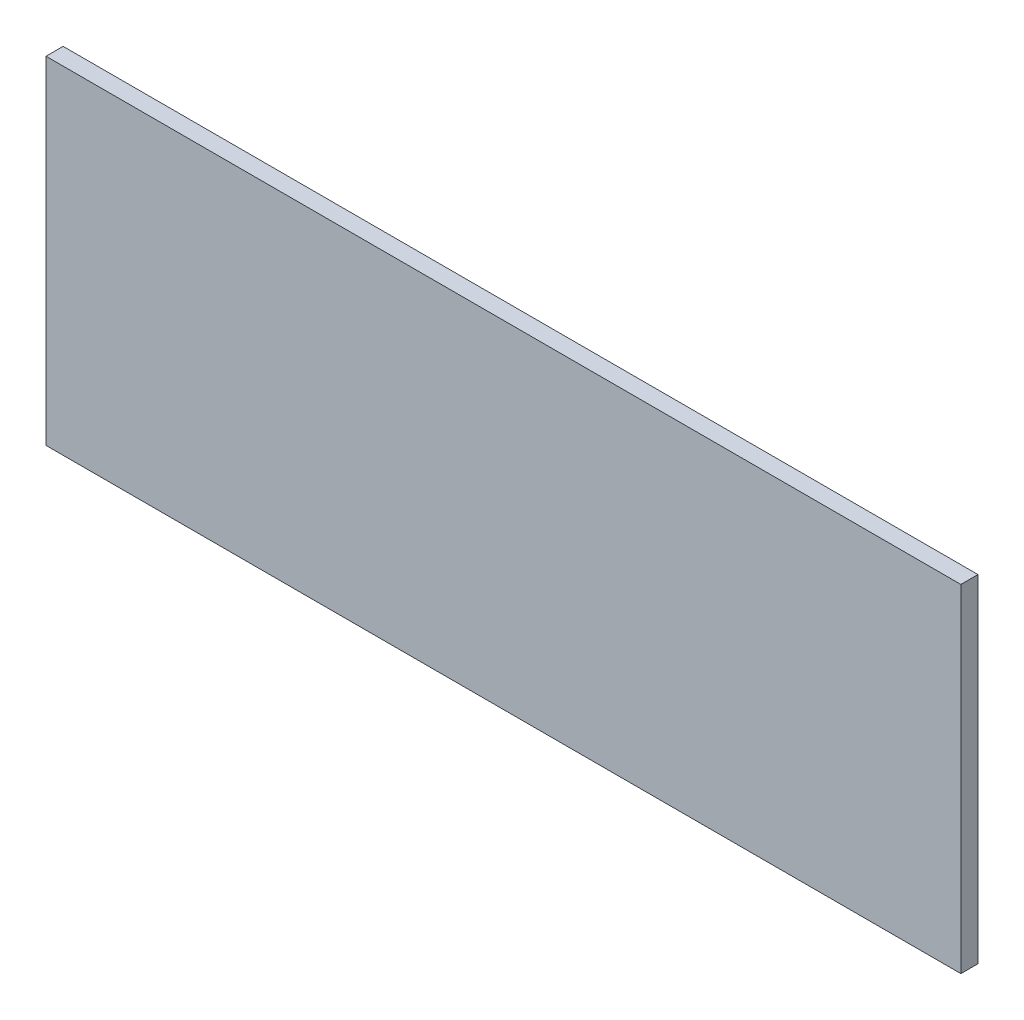
ISO-10303-21;
HEADER;
FILE_DESCRIPTION(('STEP AP214'),'2;1');
FILE_NAME('part.step','',(''),(''),'','','');
FILE_SCHEMA(('AUTOMOTIVE_DESIGN { 1 0 10303 214 1 1 1 1 }'));
ENDSEC;
DATA;
#1=APPLICATION_CONTEXT('core data for automotive mechanical design processes');
#2=APPLICATION_PROTOCOL_DEFINITION('international standard','automotive_design',2000,#1);
#3=PRODUCT_CONTEXT('',#1,'mechanical');
#4=PRODUCT('Part','Part','',(#3));
#5=PRODUCT_RELATED_PRODUCT_CATEGORY('part','',(#4));
#6=PRODUCT_DEFINITION_FORMATION('','',#4);
#7=PRODUCT_DEFINITION_CONTEXT('part definition',#1,'design');
#8=PRODUCT_DEFINITION('design','',#6,#7);
#9=PRODUCT_DEFINITION_SHAPE('','',#8);
#10=(LENGTH_UNIT() NAMED_UNIT(*) SI_UNIT(.MILLI.,.METRE.));
#11=(NAMED_UNIT(*) PLANE_ANGLE_UNIT() SI_UNIT($,.RADIAN.));
#12=(NAMED_UNIT(*) SI_UNIT($,.STERADIAN.) SOLID_ANGLE_UNIT());
#13=UNCERTAINTY_MEASURE_WITH_UNIT(LENGTH_MEASURE(1.E-05),#10,'distance_accuracy_value','');
#14=(GEOMETRIC_REPRESENTATION_CONTEXT(3) GLOBAL_UNCERTAINTY_ASSIGNED_CONTEXT((#13)) GLOBAL_UNIT_ASSIGNED_CONTEXT((#10,
#11,#12)) REPRESENTATION_CONTEXT('',''));
#15=CARTESIAN_POINT('',(0.,0.,0.));
#16=DIRECTION('',(0.,0.,1.));
#17=DIRECTION('',(1.,0.,0.));
#18=AXIS2_PLACEMENT_3D('',#15,#16,#17);
#19=CARTESIAN_POINT('',(96.5670013427734,63.8370018005371,0.));
#20=DIRECTION('',(0.,1.,0.));
#21=DIRECTION('',(1.,0.,0.));
#22=AXIS2_PLACEMENT_3D('',#19,#20,#21);
#23=PLANE('',#22);
#24=DIRECTION('',(1.,0.,0.));
#25=VECTOR('',#24,1.);
#26=CARTESIAN_POINT('',(96.5670013427734,63.8370018005371,0.03556));
#27=LINE('',#26,#25);
#28=CARTESIAN_POINT('',(96.5670013427734,63.8370018005371,0.03556));
#29=VERTEX_POINT('',#28);
#30=CARTESIAN_POINT('',(98.4670028686523,63.8370018005371,0.03556));
#31=VERTEX_POINT('',#30);
#32=EDGE_CURVE('E11',#29,#31,#27,.T.);
#33=ORIENTED_EDGE('',*,*,#32,.F.);
#34=DIRECTION('',(0.,0.,1.));
#35=VECTOR('',#34,1.);
#36=CARTESIAN_POINT('',(96.5670013427734,63.8370018005371,0.));
#37=LINE('',#36,#35);
#38=CARTESIAN_POINT('',(96.5670013427734,63.8370018005371,0.));
#39=VERTEX_POINT('',#38);
#40=EDGE_CURVE('E24',#39,#29,#37,.T.);
#41=ORIENTED_EDGE('',*,*,#40,.F.);
#42=DIRECTION('',(1.,0.,0.));
#43=VECTOR('',#42,1.);
#44=CARTESIAN_POINT('',(96.5670013427734,63.8370018005371,0.));
#45=LINE('',#44,#43);
#46=CARTESIAN_POINT('',(98.4670028686523,63.8370018005371,0.));
#47=VERTEX_POINT('',#46);
#48=EDGE_CURVE('E75',#39,#47,#45,.T.);
#49=ORIENTED_EDGE('',*,*,#48,.T.);
#50=DIRECTION('',(0.,0.,1.));
#51=VECTOR('',#50,1.);
#52=CARTESIAN_POINT('',(98.4670028686523,63.8370018005371,0.));
#53=LINE('',#52,#51);
#54=EDGE_CURVE('E37',#47,#31,#53,.T.);
#55=ORIENTED_EDGE('',*,*,#54,.T.);
#56=EDGE_LOOP('',(#33,#41,#49,#55));
#57=FACE_BOUND('',#56,.T.);
#58=ADVANCED_FACE('F17',(#57),#23,.F.);
#59=CARTESIAN_POINT('',(98.4670028686523,63.8370018005371,0.));
#60=DIRECTION('',(-1.,0.,0.));
#61=DIRECTION('',(0.,1.,0.));
#62=AXIS2_PLACEMENT_3D('',#59,#60,#61);
#63=PLANE('',#62);
#64=DIRECTION('',(0.,1.,0.));
#65=VECTOR('',#64,1.);
#66=CARTESIAN_POINT('',(98.4670028686523,63.8370018005371,0.03556));
#67=LINE('',#66,#65);
#68=CARTESIAN_POINT('',(98.4670028686523,64.5370025634766,0.03556));
#69=VERTEX_POINT('',#68);
#70=EDGE_CURVE('E83',#31,#69,#67,.T.);
#71=ORIENTED_EDGE('',*,*,#70,.F.);
#72=ORIENTED_EDGE('',*,*,#54,.F.);
#73=DIRECTION('',(0.,1.,0.));
#74=VECTOR('',#73,1.);
#75=CARTESIAN_POINT('',(98.4670028686523,63.8370018005371,0.));
#76=LINE('',#75,#74);
#77=CARTESIAN_POINT('',(98.4670028686523,64.5370025634766,0.));
#78=VERTEX_POINT('',#77);
#79=EDGE_CURVE('E81',#47,#78,#76,.T.);
#80=ORIENTED_EDGE('',*,*,#79,.T.);
#81=DIRECTION('',(0.,0.,1.));
#82=VECTOR('',#81,1.);
#83=CARTESIAN_POINT('',(98.4670028686523,64.5370025634766,0.));
#84=LINE('',#83,#82);
#85=EDGE_CURVE('E67',#78,#69,#84,.T.);
#86=ORIENTED_EDGE('',*,*,#85,.T.);
#87=EDGE_LOOP('',(#71,#72,#80,#86));
#88=FACE_BOUND('',#87,.T.);
#89=ADVANCED_FACE('F89',(#88),#63,.F.);
#90=CARTESIAN_POINT('',(98.4670028686523,64.5370025634766,0.));
#91=DIRECTION('',(0.,-1.,0.));
#92=DIRECTION('',(-1.,0.,0.));
#93=AXIS2_PLACEMENT_3D('',#90,#91,#92);
#94=PLANE('',#93);
#95=DIRECTION('',(-1.,0.,0.));
#96=VECTOR('',#95,1.);
#97=CARTESIAN_POINT('',(98.4670028686523,64.5370025634766,0.03556));
#98=LINE('',#97,#96);
#99=CARTESIAN_POINT('',(96.5670013427734,64.5370025634766,0.03556));
#100=VERTEX_POINT('',#99);
#101=EDGE_CURVE('E71',#69,#100,#98,.T.);
#102=ORIENTED_EDGE('',*,*,#101,.F.);
#103=ORIENTED_EDGE('',*,*,#85,.F.);
#104=DIRECTION('',(-1.,0.,0.));
#105=VECTOR('',#104,1.);
#106=CARTESIAN_POINT('',(98.4670028686523,64.5370025634766,0.));
#107=LINE('',#106,#105);
#108=CARTESIAN_POINT('',(96.5670013427734,64.5370025634766,0.));
#109=VERTEX_POINT('',#108);
#110=EDGE_CURVE('E63',#78,#109,#107,.T.);
#111=ORIENTED_EDGE('',*,*,#110,.T.);
#112=DIRECTION('',(0.,0.,1.));
#113=VECTOR('',#112,1.);
#114=CARTESIAN_POINT('',(96.5670013427734,64.5370025634766,0.));
#115=LINE('',#114,#113);
#116=EDGE_CURVE('E53',#109,#100,#115,.T.);
#117=ORIENTED_EDGE('',*,*,#116,.T.);
#118=EDGE_LOOP('',(#102,#103,#111,#117));
#119=FACE_BOUND('',#118,.T.);
#120=ADVANCED_FACE('F66',(#119),#94,.F.);
#121=CARTESIAN_POINT('',(96.5670013427734,64.5370025634766,0.));
#122=DIRECTION('',(1.,0.,0.));
#123=DIRECTION('',(0.,-1.,0.));
#124=AXIS2_PLACEMENT_3D('',#121,#122,#123);
#125=PLANE('',#124);
#126=DIRECTION('',(0.,-1.,0.));
#127=VECTOR('',#126,1.);
#128=CARTESIAN_POINT('',(96.5670013427734,64.5370025634766,0.03556));
#129=LINE('',#128,#127);
#130=EDGE_CURVE('E59',#100,#29,#129,.T.);
#131=ORIENTED_EDGE('',*,*,#130,.F.);
#132=ORIENTED_EDGE('',*,*,#116,.F.);
#133=DIRECTION('',(0.,-1.,0.));
#134=VECTOR('',#133,1.);
#135=CARTESIAN_POINT('',(96.5670013427734,64.5370025634766,0.));
#136=LINE('',#135,#134);
#137=EDGE_CURVE('E57',#109,#39,#136,.T.);
#138=ORIENTED_EDGE('',*,*,#137,.T.);
#139=ORIENTED_EDGE('',*,*,#40,.T.);
#140=EDGE_LOOP('',(#131,#132,#138,#139));
#141=FACE_BOUND('',#140,.T.);
#142=ADVANCED_FACE('F55',(#141),#125,.F.);
#143=CARTESIAN_POINT('',(96.5670013427734,63.8370018005371,0.));
#144=DIRECTION('',(0.,0.,-1.));
#145=DIRECTION('',(-1.,0.,0.));
#146=AXIS2_PLACEMENT_3D('',#143,#144,#145);
#147=PLANE('',#146);
#148=ORIENTED_EDGE('',*,*,#137,.F.);
#149=ORIENTED_EDGE('',*,*,#110,.F.);
#150=ORIENTED_EDGE('',*,*,#79,.F.);
#151=ORIENTED_EDGE('',*,*,#48,.F.);
#152=EDGE_LOOP('',(#148,#149,#150,#151));
#153=FACE_BOUND('',#152,.T.);
#154=ADVANCED_FACE('F74',(#153),#147,.T.);
#155=CARTESIAN_POINT('',(96.5670013427734,63.8370018005371,0.03556));
#156=DIRECTION('',(0.,0.,-1.));
#157=DIRECTION('',(-1.,0.,0.));
#158=AXIS2_PLACEMENT_3D('',#155,#156,#157);
#159=PLANE('',#158);
#160=ORIENTED_EDGE('',*,*,#32,.T.);
#161=ORIENTED_EDGE('',*,*,#70,.T.);
#162=ORIENTED_EDGE('',*,*,#101,.T.);
#163=ORIENTED_EDGE('',*,*,#130,.T.);
#164=EDGE_LOOP('',(#160,#161,#162,#163));
#165=FACE_BOUND('',#164,.T.);
#166=ADVANCED_FACE('F91',(#165),#159,.F.);
#167=CLOSED_SHELL('',(#58,#89,#120,#142,#154,#166));
#168=MANIFOLD_SOLID_BREP('B1',#167);
#169=ADVANCED_BREP_SHAPE_REPRESENTATION('',(#18,#168),#14);
#170=SHAPE_DEFINITION_REPRESENTATION(#9,#169);
ENDSEC;
END-ISO-10303-21;
